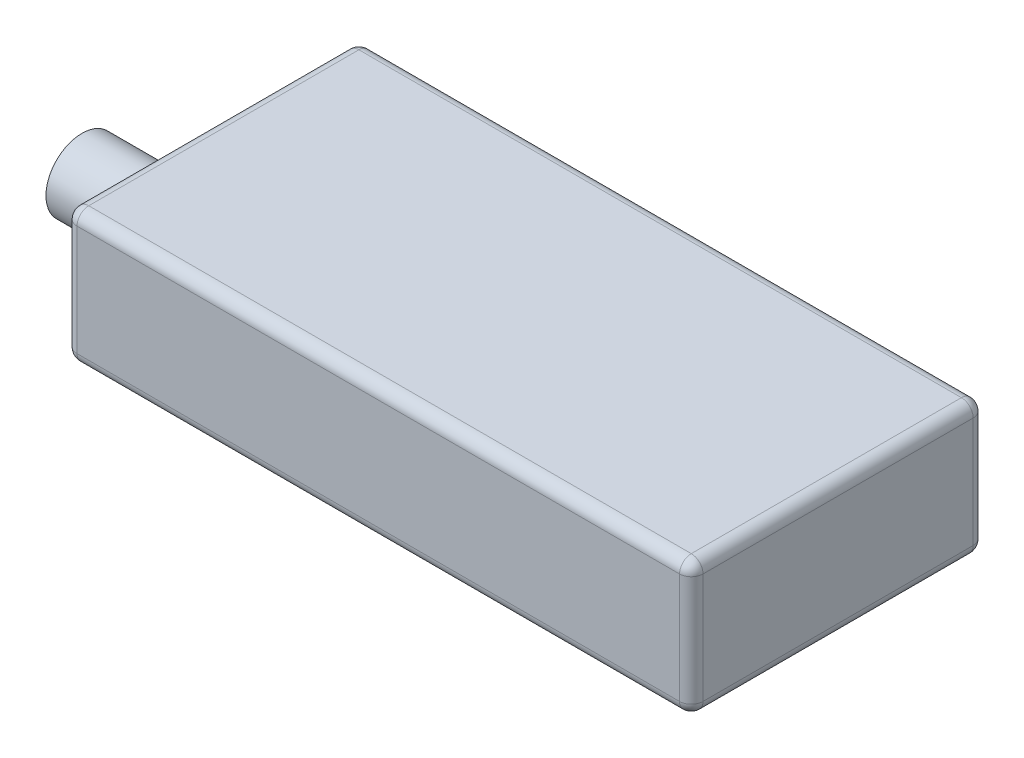
ISO-10303-21;
HEADER;
FILE_DESCRIPTION(('STEP AP214'),'2;1');
FILE_NAME('part.step','',(''),(''),'','','');
FILE_SCHEMA(('AUTOMOTIVE_DESIGN { 1 0 10303 214 1 1 1 1 }'));
ENDSEC;
DATA;
#1=APPLICATION_CONTEXT('core data for automotive mechanical design processes');
#2=APPLICATION_PROTOCOL_DEFINITION('international standard','automotive_design',2000,#1);
#3=PRODUCT_CONTEXT('',#1,'mechanical');
#4=PRODUCT('Part','Part','',(#3));
#5=PRODUCT_RELATED_PRODUCT_CATEGORY('part','',(#4));
#6=PRODUCT_DEFINITION_FORMATION('','',#4);
#7=PRODUCT_DEFINITION_CONTEXT('part definition',#1,'design');
#8=PRODUCT_DEFINITION('design','',#6,#7);
#9=PRODUCT_DEFINITION_SHAPE('','',#8);
#10=(LENGTH_UNIT() NAMED_UNIT(*) SI_UNIT(.MILLI.,.METRE.));
#11=(NAMED_UNIT(*) PLANE_ANGLE_UNIT() SI_UNIT($,.RADIAN.));
#12=(NAMED_UNIT(*) SI_UNIT($,.STERADIAN.) SOLID_ANGLE_UNIT());
#13=UNCERTAINTY_MEASURE_WITH_UNIT(LENGTH_MEASURE(1.E-05),#10,'distance_accuracy_value','');
#14=(GEOMETRIC_REPRESENTATION_CONTEXT(3) GLOBAL_UNCERTAINTY_ASSIGNED_CONTEXT((#13)) GLOBAL_UNIT_ASSIGNED_CONTEXT((#10,
#11,#12)) REPRESENTATION_CONTEXT('',''));
#15=CARTESIAN_POINT('',(0.,0.,0.));
#16=DIRECTION('',(0.,0.,1.));
#17=DIRECTION('',(1.,0.,0.));
#18=AXIS2_PLACEMENT_3D('',#15,#16,#17);
#19=CARTESIAN_POINT('',(26.65,11.4,12.5));
#20=DIRECTION('',(-1.,0.,0.));
#21=DIRECTION('',(0.,0.,1.));
#22=AXIS2_PLACEMENT_3D('',#19,#20,#21);
#23=PLANE('',#22);
#24=DIRECTION('',(0.,-1.,0.));
#25=VECTOR('',#24,1.);
#26=CARTESIAN_POINT('',(26.65,11.4,11.5));
#27=LINE('',#26,#25);
#28=CARTESIAN_POINT('',(26.65,10.4,11.5));
#29=VERTEX_POINT('',#28);
#30=CARTESIAN_POINT('',(26.65,1.,11.5));
#31=VERTEX_POINT('',#30);
#32=EDGE_CURVE('E169',#29,#31,#27,.T.);
#33=ORIENTED_EDGE('',*,*,#32,.T.);
#34=DIRECTION('',(0.,0.,-1.));
#35=VECTOR('',#34,1.);
#36=CARTESIAN_POINT('',(26.65,1.,-12.5));
#37=LINE('',#36,#35);
#38=CARTESIAN_POINT('',(26.65,1.,-11.5));
#39=VERTEX_POINT('',#38);
#40=EDGE_CURVE('E174',#31,#39,#37,.T.);
#41=ORIENTED_EDGE('',*,*,#40,.T.);
#42=DIRECTION('',(0.,-1.,0.));
#43=VECTOR('',#42,1.);
#44=CARTESIAN_POINT('',(26.65,11.4,-11.5));
#45=LINE('',#44,#43);
#46=CARTESIAN_POINT('',(26.65,10.4,-11.5));
#47=VERTEX_POINT('',#46);
#48=EDGE_CURVE('E171',#39,#47,#45,.F.);
#49=ORIENTED_EDGE('',*,*,#48,.T.);
#50=DIRECTION('',(0.,0.,-1.));
#51=VECTOR('',#50,1.);
#52=CARTESIAN_POINT('',(26.65,10.4,12.5));
#53=LINE('',#52,#51);
#54=EDGE_CURVE('E167',#47,#29,#53,.F.);
#55=ORIENTED_EDGE('',*,*,#54,.T.);
#56=EDGE_LOOP('',(#33,#41,#49,#55));
#57=FACE_BOUND('',#56,.T.);
#58=ADVANCED_FACE('F33',(#57),#23,.F.);
#59=CARTESIAN_POINT('',(-26.65,11.4,-12.5));
#60=DIRECTION('',(0.,0.,1.));
#61=DIRECTION('',(1.,0.,0.));
#62=AXIS2_PLACEMENT_3D('',#59,#60,#61);
#63=PLANE('',#62);
#64=DIRECTION('',(0.,-1.,0.));
#65=VECTOR('',#64,1.);
#66=CARTESIAN_POINT('',(25.65,11.4,-12.5));
#67=LINE('',#66,#65);
#68=CARTESIAN_POINT('',(25.65,10.4,-12.5));
#69=VERTEX_POINT('',#68);
#70=CARTESIAN_POINT('',(25.65,1.,-12.5));
#71=VERTEX_POINT('',#70);
#72=EDGE_CURVE('E132',#69,#71,#67,.T.);
#73=ORIENTED_EDGE('',*,*,#72,.T.);
#74=DIRECTION('',(-1.,0.,0.));
#75=VECTOR('',#74,1.);
#76=CARTESIAN_POINT('',(-26.65,1.,-12.5));
#77=LINE('',#76,#75);
#78=CARTESIAN_POINT('',(-25.65,1.,-12.5));
#79=VERTEX_POINT('',#78);
#80=EDGE_CURVE('E128',#71,#79,#77,.T.);
#81=ORIENTED_EDGE('',*,*,#80,.T.);
#82=DIRECTION('',(0.,-1.,0.));
#83=VECTOR('',#82,1.);
#84=CARTESIAN_POINT('',(-25.65,11.4,-12.5));
#85=LINE('',#84,#83);
#86=CARTESIAN_POINT('',(-25.65,10.4,-12.5));
#87=VERTEX_POINT('',#86);
#88=EDGE_CURVE('E120',#79,#87,#85,.F.);
#89=ORIENTED_EDGE('',*,*,#88,.T.);
#90=DIRECTION('',(-1.,0.,0.));
#91=VECTOR('',#90,1.);
#92=CARTESIAN_POINT('',(-26.65,10.4,-12.5));
#93=LINE('',#92,#91);
#94=EDGE_CURVE('E125',#87,#69,#93,.F.);
#95=ORIENTED_EDGE('',*,*,#94,.T.);
#96=EDGE_LOOP('',(#73,#81,#89,#95));
#97=FACE_BOUND('',#96,.T.);
#98=ADVANCED_FACE('F123',(#97),#63,.F.);
#99=CARTESIAN_POINT('',(-26.65,11.4,12.5));
#100=DIRECTION('',(1.,0.,0.));
#101=DIRECTION('',(0.,0.,-1.));
#102=AXIS2_PLACEMENT_3D('',#99,#100,#101);
#103=PLANE('',#102);
#104=CARTESIAN_POINT('',(-26.65,6.865,4.975));
#105=DIRECTION('',(1.,0.,0.));
#106=DIRECTION('',(0.,0.,-1.));
#107=AXIS2_PLACEMENT_3D('',#104,#105,#106);
#108=CIRCLE('',#107,3.065);
#109=CARTESIAN_POINT('',(-26.65,6.865,1.91));
#110=VERTEX_POINT('',#109);
#111=EDGE_CURVE('E11',#110,#110,#108,.F.);
#112=ORIENTED_EDGE('',*,*,#111,.F.);
#113=EDGE_LOOP('',(#112));
#114=FACE_BOUND('',#113,.T.);
#115=DIRECTION('',(0.,-1.,0.));
#116=VECTOR('',#115,1.);
#117=CARTESIAN_POINT('',(-26.65,11.4,-11.5));
#118=LINE('',#117,#116);
#119=CARTESIAN_POINT('',(-26.65,10.4,-11.5));
#120=VERTEX_POINT('',#119);
#121=CARTESIAN_POINT('',(-26.65,1.,-11.5));
#122=VERTEX_POINT('',#121);
#123=EDGE_CURVE('E140',#120,#122,#118,.T.);
#124=ORIENTED_EDGE('',*,*,#123,.T.);
#125=DIRECTION('',(0.,0.,1.));
#126=VECTOR('',#125,1.);
#127=CARTESIAN_POINT('',(-26.65,1.,12.5));
#128=LINE('',#127,#126);
#129=CARTESIAN_POINT('',(-26.65,1.,11.5));
#130=VERTEX_POINT('',#129);
#131=EDGE_CURVE('E181',#122,#130,#128,.T.);
#132=ORIENTED_EDGE('',*,*,#131,.T.);
#133=DIRECTION('',(0.,-1.,0.));
#134=VECTOR('',#133,1.);
#135=CARTESIAN_POINT('',(-26.65,11.4,11.5));
#136=LINE('',#135,#134);
#137=CARTESIAN_POINT('',(-26.65,10.4,11.5));
#138=VERTEX_POINT('',#137);
#139=EDGE_CURVE('E178',#130,#138,#136,.F.);
#140=ORIENTED_EDGE('',*,*,#139,.T.);
#141=DIRECTION('',(0.,0.,1.));
#142=VECTOR('',#141,1.);
#143=CARTESIAN_POINT('',(-26.65,10.4,12.5));
#144=LINE('',#143,#142);
#145=EDGE_CURVE('E176',#138,#120,#144,.F.);
#146=ORIENTED_EDGE('',*,*,#145,.T.);
#147=EDGE_LOOP('',(#124,#132,#140,#146));
#148=FACE_BOUND('',#147,.T.);
#149=ADVANCED_FACE('F329',(#114,#148),#103,.F.);
#150=CARTESIAN_POINT('',(-26.65,11.4,12.5));
#151=DIRECTION('',(0.,0.,-1.));
#152=DIRECTION('',(-1.,0.,0.));
#153=AXIS2_PLACEMENT_3D('',#150,#151,#152);
#154=PLANE('',#153);
#155=DIRECTION('',(0.,-1.,0.));
#156=VECTOR('',#155,1.);
#157=CARTESIAN_POINT('',(-25.65,11.4,12.5));
#158=LINE('',#157,#156);
#159=CARTESIAN_POINT('',(-25.65,10.4,12.5));
#160=VERTEX_POINT('',#159);
#161=CARTESIAN_POINT('',(-25.65,1.,12.5));
#162=VERTEX_POINT('',#161);
#163=EDGE_CURVE('E187',#160,#162,#158,.T.);
#164=ORIENTED_EDGE('',*,*,#163,.T.);
#165=DIRECTION('',(1.,0.,0.));
#166=VECTOR('',#165,1.);
#167=CARTESIAN_POINT('',(26.65,1.,12.5));
#168=LINE('',#167,#166);
#169=CARTESIAN_POINT('',(25.65,1.,12.5));
#170=VERTEX_POINT('',#169);
#171=EDGE_CURVE('E190',#162,#170,#168,.T.);
#172=ORIENTED_EDGE('',*,*,#171,.T.);
#173=DIRECTION('',(0.,-1.,0.));
#174=VECTOR('',#173,1.);
#175=CARTESIAN_POINT('',(25.65,11.4,12.5));
#176=LINE('',#175,#174);
#177=CARTESIAN_POINT('',(25.65,10.4,12.5));
#178=VERTEX_POINT('',#177);
#179=EDGE_CURVE('E185',#170,#178,#176,.F.);
#180=ORIENTED_EDGE('',*,*,#179,.T.);
#181=DIRECTION('',(1.,0.,0.));
#182=VECTOR('',#181,1.);
#183=CARTESIAN_POINT('',(-26.65,10.4,12.5));
#184=LINE('',#183,#182);
#185=EDGE_CURVE('E183',#178,#160,#184,.F.);
#186=ORIENTED_EDGE('',*,*,#185,.T.);
#187=EDGE_LOOP('',(#164,#172,#180,#186));
#188=FACE_BOUND('',#187,.T.);
#189=ADVANCED_FACE('F278',(#188),#154,.F.);
#190=CARTESIAN_POINT('',(0.,11.4,0.));
#191=DIRECTION('',(0.,-1.,0.));
#192=DIRECTION('',(0.,0.,-1.));
#193=AXIS2_PLACEMENT_3D('',#190,#191,#192);
#194=PLANE('',#193);
#195=DIRECTION('',(0.,0.,1.));
#196=VECTOR('',#195,1.);
#197=CARTESIAN_POINT('',(-25.65,11.4,0.));
#198=LINE('',#197,#196);
#199=CARTESIAN_POINT('',(-25.65,11.4,-11.5));
#200=VERTEX_POINT('',#199);
#201=CARTESIAN_POINT('',(-25.65,11.4,11.5));
#202=VERTEX_POINT('',#201);
#203=EDGE_CURVE('E48',#200,#202,#198,.T.);
#204=ORIENTED_EDGE('',*,*,#203,.T.);
#205=DIRECTION('',(1.,0.,0.));
#206=VECTOR('',#205,1.);
#207=CARTESIAN_POINT('',(0.,11.4,11.5));
#208=LINE('',#207,#206);
#209=CARTESIAN_POINT('',(25.65,11.4,11.5));
#210=VERTEX_POINT('',#209);
#211=EDGE_CURVE('E41',#202,#210,#208,.T.);
#212=ORIENTED_EDGE('',*,*,#211,.T.);
#213=DIRECTION('',(0.,0.,-1.));
#214=VECTOR('',#213,1.);
#215=CARTESIAN_POINT('',(25.65,11.4,0.));
#216=LINE('',#215,#214);
#217=CARTESIAN_POINT('',(25.65,11.4,-11.5));
#218=VERTEX_POINT('',#217);
#219=EDGE_CURVE('E201',#210,#218,#216,.T.);
#220=ORIENTED_EDGE('',*,*,#219,.T.);
#221=DIRECTION('',(-1.,0.,0.));
#222=VECTOR('',#221,1.);
#223=CARTESIAN_POINT('',(0.,11.4,-11.5));
#224=LINE('',#223,#222);
#225=EDGE_CURVE('E53',#218,#200,#224,.T.);
#226=ORIENTED_EDGE('',*,*,#225,.T.);
#227=EDGE_LOOP('',(#204,#212,#220,#226));
#228=FACE_BOUND('',#227,.T.);
#229=ADVANCED_FACE('F293',(#228),#194,.F.);
#230=CARTESIAN_POINT('',(0.,0.,0.));
#231=DIRECTION('',(0.,-1.,0.));
#232=DIRECTION('',(0.,0.,-1.));
#233=AXIS2_PLACEMENT_3D('',#230,#231,#232);
#234=PLANE('',#233);
#235=DIRECTION('',(0.,0.,1.));
#236=VECTOR('',#235,1.);
#237=CARTESIAN_POINT('',(-25.65,0.,-12.5));
#238=LINE('',#237,#236);
#239=CARTESIAN_POINT('',(-25.65,0.,11.5));
#240=VERTEX_POINT('',#239);
#241=CARTESIAN_POINT('',(-25.65,0.,-11.5));
#242=VERTEX_POINT('',#241);
#243=EDGE_CURVE('E196',#240,#242,#238,.F.);
#244=ORIENTED_EDGE('',*,*,#243,.T.);
#245=DIRECTION('',(-1.,0.,0.));
#246=VECTOR('',#245,1.);
#247=CARTESIAN_POINT('',(26.65,0.,-11.5));
#248=LINE('',#247,#246);
#249=CARTESIAN_POINT('',(25.65,0.,-11.5));
#250=VERTEX_POINT('',#249);
#251=EDGE_CURVE('E198',#242,#250,#248,.F.);
#252=ORIENTED_EDGE('',*,*,#251,.T.);
#253=DIRECTION('',(0.,0.,-1.));
#254=VECTOR('',#253,1.);
#255=CARTESIAN_POINT('',(25.65,0.,12.5));
#256=LINE('',#255,#254);
#257=CARTESIAN_POINT('',(25.65,0.,11.5));
#258=VERTEX_POINT('',#257);
#259=EDGE_CURVE('E192',#250,#258,#256,.F.);
#260=ORIENTED_EDGE('',*,*,#259,.T.);
#261=DIRECTION('',(1.,0.,0.));
#262=VECTOR('',#261,1.);
#263=CARTESIAN_POINT('',(-26.65,0.,11.5));
#264=LINE('',#263,#262);
#265=EDGE_CURVE('E194',#258,#240,#264,.F.);
#266=ORIENTED_EDGE('',*,*,#265,.T.);
#267=EDGE_LOOP('',(#244,#252,#260,#266));
#268=FACE_BOUND('',#267,.T.);
#269=ADVANCED_FACE('F269',(#268),#234,.T.);
#270=CARTESIAN_POINT('',(-25.65,11.4,11.5));
#271=DIRECTION('',(0.,-1.,0.));
#272=DIRECTION('',(0.,0.,-1.));
#273=AXIS2_PLACEMENT_3D('',#270,#271,#272);
#274=CYLINDRICAL_SURFACE('',#273,1.);
#275=CARTESIAN_POINT('',(-25.65,10.4,11.5));
#276=DIRECTION('',(0.,1.,0.));
#277=DIRECTION('',(0.,0.,1.));
#278=AXIS2_PLACEMENT_3D('',#275,#276,#277);
#279=CIRCLE('',#278,1.);
#280=EDGE_CURVE('E158',#138,#160,#279,.T.);
#281=ORIENTED_EDGE('',*,*,#280,.F.);
#282=ORIENTED_EDGE('',*,*,#139,.F.);
#283=CARTESIAN_POINT('',(-25.65,1.,11.5));
#284=DIRECTION('',(0.,-1.,0.));
#285=DIRECTION('',(0.,0.,-1.));
#286=AXIS2_PLACEMENT_3D('',#283,#284,#285);
#287=CIRCLE('',#286,1.);
#288=EDGE_CURVE('E161',#162,#130,#287,.T.);
#289=ORIENTED_EDGE('',*,*,#288,.F.);
#290=ORIENTED_EDGE('',*,*,#163,.F.);
#291=EDGE_LOOP('',(#281,#282,#289,#290));
#292=FACE_BOUND('',#291,.T.);
#293=ADVANCED_FACE('F35',(#292),#274,.T.);
#294=CARTESIAN_POINT('',(-25.65,10.4,11.5));
#295=DIRECTION('',(0.,0.,1.));
#296=DIRECTION('',(1.,0.,0.));
#297=AXIS2_PLACEMENT_3D('',#294,#295,#296);
#298=SPHERICAL_SURFACE('',#297,1.);
#299=CARTESIAN_POINT('',(-25.65,10.4,11.5));
#300=DIRECTION('',(0.,0.,1.));
#301=DIRECTION('',(1.,0.,0.));
#302=AXIS2_PLACEMENT_3D('',#299,#300,#301);
#303=CIRCLE('',#302,1.);
#304=EDGE_CURVE('E248',#138,#202,#303,.F.);
#305=ORIENTED_EDGE('',*,*,#304,.F.);
#306=ORIENTED_EDGE('',*,*,#280,.T.);
#307=CARTESIAN_POINT('',(-25.65,10.4,11.5));
#308=DIRECTION('',(-1.,0.,0.));
#309=DIRECTION('',(0.,0.,1.));
#310=AXIS2_PLACEMENT_3D('',#307,#308,#309);
#311=CIRCLE('',#310,1.);
#312=EDGE_CURVE('E250',#202,#160,#311,.F.);
#313=ORIENTED_EDGE('',*,*,#312,.F.);
#314=EDGE_LOOP('',(#305,#306,#313));
#315=FACE_BOUND('',#314,.T.);
#316=ADVANCED_FACE('F483',(#315),#298,.T.);
#317=CARTESIAN_POINT('',(-25.65,1.,11.5));
#318=DIRECTION('',(0.,0.,1.));
#319=DIRECTION('',(1.,0.,0.));
#320=AXIS2_PLACEMENT_3D('',#317,#318,#319);
#321=SPHERICAL_SURFACE('',#320,1.);
#322=CARTESIAN_POINT('',(-25.65,1.,11.5));
#323=DIRECTION('',(-1.,0.,0.));
#324=DIRECTION('',(0.,0.,1.));
#325=AXIS2_PLACEMENT_3D('',#322,#323,#324);
#326=CIRCLE('',#325,1.);
#327=EDGE_CURVE('E242',#162,#240,#326,.F.);
#328=ORIENTED_EDGE('',*,*,#327,.F.);
#329=ORIENTED_EDGE('',*,*,#288,.T.);
#330=CARTESIAN_POINT('',(-25.65,1.,11.5));
#331=DIRECTION('',(0.,0.,1.));
#332=DIRECTION('',(1.,0.,0.));
#333=AXIS2_PLACEMENT_3D('',#330,#331,#332);
#334=CIRCLE('',#333,1.);
#335=EDGE_CURVE('E245',#240,#130,#334,.F.);
#336=ORIENTED_EDGE('',*,*,#335,.F.);
#337=EDGE_LOOP('',(#328,#329,#336));
#338=FACE_BOUND('',#337,.T.);
#339=ADVANCED_FACE('F258',(#338),#321,.T.);
#340=CARTESIAN_POINT('',(0.,10.4,11.5));
#341=DIRECTION('',(1.,0.,0.));
#342=DIRECTION('',(0.,0.,-1.));
#343=AXIS2_PLACEMENT_3D('',#340,#341,#342);
#344=CYLINDRICAL_SURFACE('',#343,1.);
#345=ORIENTED_EDGE('',*,*,#312,.T.);
#346=ORIENTED_EDGE('',*,*,#185,.F.);
#347=CARTESIAN_POINT('',(25.65,10.4,11.5));
#348=DIRECTION('',(1.,0.,0.));
#349=DIRECTION('',(0.,0.,-1.));
#350=AXIS2_PLACEMENT_3D('',#347,#348,#349);
#351=CIRCLE('',#350,1.);
#352=EDGE_CURVE('E236',#210,#178,#351,.T.);
#353=ORIENTED_EDGE('',*,*,#352,.F.);
#354=ORIENTED_EDGE('',*,*,#211,.F.);
#355=EDGE_LOOP('',(#345,#346,#353,#354));
#356=FACE_BOUND('',#355,.T.);
#357=ADVANCED_FACE('F292',(#356),#344,.T.);
#358=CARTESIAN_POINT('',(-25.65,10.4,0.));
#359=DIRECTION('',(0.,0.,1.));
#360=DIRECTION('',(1.,0.,0.));
#361=AXIS2_PLACEMENT_3D('',#358,#359,#360);
#362=CYLINDRICAL_SURFACE('',#361,1.);
#363=ORIENTED_EDGE('',*,*,#304,.T.);
#364=ORIENTED_EDGE('',*,*,#203,.F.);
#365=CARTESIAN_POINT('',(-25.65,10.4,-11.5));
#366=DIRECTION('',(0.,0.,-1.));
#367=DIRECTION('',(0.,1.,0.));
#368=AXIS2_PLACEMENT_3D('',#365,#366,#367);
#369=CIRCLE('',#368,1.);
#370=EDGE_CURVE('E144',#120,#200,#369,.T.);
#371=ORIENTED_EDGE('',*,*,#370,.F.);
#372=ORIENTED_EDGE('',*,*,#145,.F.);
#373=EDGE_LOOP('',(#363,#364,#371,#372));
#374=FACE_BOUND('',#373,.T.);
#375=ADVANCED_FACE('F460',(#374),#362,.T.);
#376=CARTESIAN_POINT('',(-25.65,11.4,-11.5));
#377=DIRECTION('',(0.,-1.,0.));
#378=DIRECTION('',(0.,0.,-1.));
#379=AXIS2_PLACEMENT_3D('',#376,#377,#378);
#380=CYLINDRICAL_SURFACE('',#379,1.);
#381=CARTESIAN_POINT('',(-25.65,1.,-11.5));
#382=DIRECTION('',(0.,-1.,0.));
#383=DIRECTION('',(0.,0.,-1.));
#384=AXIS2_PLACEMENT_3D('',#381,#382,#383);
#385=CIRCLE('',#384,1.);
#386=EDGE_CURVE('E145',#122,#79,#385,.T.);
#387=ORIENTED_EDGE('',*,*,#386,.F.);
#388=ORIENTED_EDGE('',*,*,#123,.F.);
#389=CARTESIAN_POINT('',(-25.65,10.4,-11.5));
#390=DIRECTION('',(0.,1.,0.));
#391=DIRECTION('',(0.,0.,1.));
#392=AXIS2_PLACEMENT_3D('',#389,#390,#391);
#393=CIRCLE('',#392,1.);
#394=EDGE_CURVE('E136',#87,#120,#393,.T.);
#395=ORIENTED_EDGE('',*,*,#394,.F.);
#396=ORIENTED_EDGE('',*,*,#88,.F.);
#397=EDGE_LOOP('',(#387,#388,#395,#396));
#398=FACE_BOUND('',#397,.T.);
#399=ADVANCED_FACE('F138',(#398),#380,.T.);
#400=CARTESIAN_POINT('',(-25.65,1.,12.5));
#401=DIRECTION('',(0.,0.,-1.));
#402=DIRECTION('',(-1.,0.,0.));
#403=AXIS2_PLACEMENT_3D('',#400,#401,#402);
#404=CYLINDRICAL_SURFACE('',#403,1.);
#405=ORIENTED_EDGE('',*,*,#335,.T.);
#406=ORIENTED_EDGE('',*,*,#131,.F.);
#407=CARTESIAN_POINT('',(-25.65,1.,-11.5));
#408=DIRECTION('',(0.,0.,-1.));
#409=DIRECTION('',(-1.,0.,0.));
#410=AXIS2_PLACEMENT_3D('',#407,#408,#409);
#411=CIRCLE('',#410,1.);
#412=EDGE_CURVE('E232',#242,#122,#411,.T.);
#413=ORIENTED_EDGE('',*,*,#412,.F.);
#414=ORIENTED_EDGE('',*,*,#243,.F.);
#415=EDGE_LOOP('',(#405,#406,#413,#414));
#416=FACE_BOUND('',#415,.T.);
#417=ADVANCED_FACE('F265',(#416),#404,.T.);
#418=CARTESIAN_POINT('',(-26.65,1.,11.5));
#419=DIRECTION('',(-1.,0.,0.));
#420=DIRECTION('',(0.,0.,1.));
#421=AXIS2_PLACEMENT_3D('',#418,#419,#420);
#422=CYLINDRICAL_SURFACE('',#421,1.);
#423=ORIENTED_EDGE('',*,*,#327,.T.);
#424=ORIENTED_EDGE('',*,*,#265,.F.);
#425=CARTESIAN_POINT('',(25.65,1.,11.5));
#426=DIRECTION('',(1.,0.,0.));
#427=DIRECTION('',(0.,0.,-1.));
#428=AXIS2_PLACEMENT_3D('',#425,#426,#427);
#429=CIRCLE('',#428,1.);
#430=EDGE_CURVE('E229',#170,#258,#429,.T.);
#431=ORIENTED_EDGE('',*,*,#430,.F.);
#432=ORIENTED_EDGE('',*,*,#171,.F.);
#433=EDGE_LOOP('',(#423,#424,#431,#432));
#434=FACE_BOUND('',#433,.T.);
#435=ADVANCED_FACE('F275',(#434),#422,.T.);
#436=CARTESIAN_POINT('',(25.65,11.4,11.5));
#437=DIRECTION('',(0.,-1.,0.));
#438=DIRECTION('',(0.,0.,-1.));
#439=AXIS2_PLACEMENT_3D('',#436,#437,#438);
#440=CYLINDRICAL_SURFACE('',#439,1.);
#441=CARTESIAN_POINT('',(25.65,10.4,11.5));
#442=DIRECTION('',(0.,1.,0.));
#443=DIRECTION('',(0.,0.,1.));
#444=AXIS2_PLACEMENT_3D('',#441,#442,#443);
#445=CIRCLE('',#444,1.);
#446=EDGE_CURVE('E239',#178,#29,#445,.T.);
#447=ORIENTED_EDGE('',*,*,#446,.F.);
#448=ORIENTED_EDGE('',*,*,#179,.F.);
#449=CARTESIAN_POINT('',(25.65,1.,11.5));
#450=DIRECTION('',(0.,-1.,0.));
#451=DIRECTION('',(0.,0.,-1.));
#452=AXIS2_PLACEMENT_3D('',#449,#450,#451);
#453=CIRCLE('',#452,1.);
#454=EDGE_CURVE('E226',#31,#170,#453,.T.);
#455=ORIENTED_EDGE('',*,*,#454,.F.);
#456=ORIENTED_EDGE('',*,*,#32,.F.);
#457=EDGE_LOOP('',(#447,#448,#455,#456));
#458=FACE_BOUND('',#457,.T.);
#459=ADVANCED_FACE('F283',(#458),#440,.T.);
#460=CARTESIAN_POINT('',(25.65,10.4,11.5));
#461=DIRECTION('',(0.,0.,1.));
#462=DIRECTION('',(1.,0.,0.));
#463=AXIS2_PLACEMENT_3D('',#460,#461,#462);
#464=SPHERICAL_SURFACE('',#463,1.);
#465=ORIENTED_EDGE('',*,*,#352,.T.);
#466=ORIENTED_EDGE('',*,*,#446,.T.);
#467=CARTESIAN_POINT('',(25.65,10.4,11.5));
#468=DIRECTION('',(0.,0.,1.));
#469=DIRECTION('',(1.,0.,0.));
#470=AXIS2_PLACEMENT_3D('',#467,#468,#469);
#471=CIRCLE('',#470,1.);
#472=EDGE_CURVE('E151',#210,#29,#471,.F.);
#473=ORIENTED_EDGE('',*,*,#472,.F.);
#474=EDGE_LOOP('',(#465,#466,#473));
#475=FACE_BOUND('',#474,.T.);
#476=ADVANCED_FACE('F289',(#475),#464,.T.);
#477=CARTESIAN_POINT('',(-25.65,10.4,-11.5));
#478=DIRECTION('',(0.,0.,1.));
#479=DIRECTION('',(1.,0.,0.));
#480=AXIS2_PLACEMENT_3D('',#477,#478,#479);
#481=SPHERICAL_SURFACE('',#480,1.);
#482=ORIENTED_EDGE('',*,*,#394,.T.);
#483=ORIENTED_EDGE('',*,*,#370,.T.);
#484=CARTESIAN_POINT('',(-25.65,10.4,-11.5));
#485=DIRECTION('',(-1.,0.,0.));
#486=DIRECTION('',(0.,0.,1.));
#487=AXIS2_PLACEMENT_3D('',#484,#485,#486);
#488=CIRCLE('',#487,1.);
#489=EDGE_CURVE('E148',#87,#200,#488,.F.);
#490=ORIENTED_EDGE('',*,*,#489,.F.);
#491=EDGE_LOOP('',(#482,#483,#490));
#492=FACE_BOUND('',#491,.T.);
#493=ADVANCED_FACE('F149',(#492),#481,.T.);
#494=CARTESIAN_POINT('',(-25.65,1.,-11.5));
#495=DIRECTION('',(0.,0.,1.));
#496=DIRECTION('',(1.,0.,0.));
#497=AXIS2_PLACEMENT_3D('',#494,#495,#496);
#498=SPHERICAL_SURFACE('',#497,1.);
#499=ORIENTED_EDGE('',*,*,#412,.T.);
#500=ORIENTED_EDGE('',*,*,#386,.T.);
#501=CARTESIAN_POINT('',(-25.65,1.,-11.5));
#502=DIRECTION('',(-1.,0.,0.));
#503=DIRECTION('',(0.,0.,1.));
#504=AXIS2_PLACEMENT_3D('',#501,#502,#503);
#505=CIRCLE('',#504,1.);
#506=EDGE_CURVE('E152',#242,#79,#505,.F.);
#507=ORIENTED_EDGE('',*,*,#506,.F.);
#508=EDGE_LOOP('',(#499,#500,#507));
#509=FACE_BOUND('',#508,.T.);
#510=ADVANCED_FACE('F312',(#509),#498,.T.);
#511=CARTESIAN_POINT('',(25.65,1.,11.5));
#512=DIRECTION('',(0.,0.,1.));
#513=DIRECTION('',(1.,0.,0.));
#514=AXIS2_PLACEMENT_3D('',#511,#512,#513);
#515=SPHERICAL_SURFACE('',#514,1.);
#516=ORIENTED_EDGE('',*,*,#454,.T.);
#517=ORIENTED_EDGE('',*,*,#430,.T.);
#518=CARTESIAN_POINT('',(25.65,1.,11.5));
#519=DIRECTION('',(0.,0.,1.));
#520=DIRECTION('',(1.,0.,0.));
#521=AXIS2_PLACEMENT_3D('',#518,#519,#520);
#522=CIRCLE('',#521,1.);
#523=EDGE_CURVE('E219',#31,#258,#522,.F.);
#524=ORIENTED_EDGE('',*,*,#523,.F.);
#525=EDGE_LOOP('',(#516,#517,#524));
#526=FACE_BOUND('',#525,.T.);
#527=ADVANCED_FACE('F314',(#526),#515,.T.);
#528=CARTESIAN_POINT('',(25.65,10.4,0.));
#529=DIRECTION('',(0.,0.,-1.));
#530=DIRECTION('',(-1.,0.,0.));
#531=AXIS2_PLACEMENT_3D('',#528,#529,#530);
#532=CYLINDRICAL_SURFACE('',#531,1.);
#533=ORIENTED_EDGE('',*,*,#472,.T.);
#534=ORIENTED_EDGE('',*,*,#54,.F.);
#535=CARTESIAN_POINT('',(25.65,10.4,-11.5));
#536=DIRECTION('',(0.,0.,-1.));
#537=DIRECTION('',(-1.,0.,0.));
#538=AXIS2_PLACEMENT_3D('',#535,#536,#537);
#539=CIRCLE('',#538,1.);
#540=EDGE_CURVE('E216',#218,#47,#539,.T.);
#541=ORIENTED_EDGE('',*,*,#540,.F.);
#542=ORIENTED_EDGE('',*,*,#219,.F.);
#543=EDGE_LOOP('',(#533,#534,#541,#542));
#544=FACE_BOUND('',#543,.T.);
#545=ADVANCED_FACE('F297',(#544),#532,.T.);
#546=CARTESIAN_POINT('',(0.,10.4,-11.5));
#547=DIRECTION('',(-1.,0.,0.));
#548=DIRECTION('',(0.,0.,1.));
#549=AXIS2_PLACEMENT_3D('',#546,#547,#548);
#550=CYLINDRICAL_SURFACE('',#549,1.);
#551=ORIENTED_EDGE('',*,*,#489,.T.);
#552=ORIENTED_EDGE('',*,*,#225,.F.);
#553=CARTESIAN_POINT('',(25.65,10.4,-11.5));
#554=DIRECTION('',(1.,0.,0.));
#555=DIRECTION('',(0.,0.,-1.));
#556=AXIS2_PLACEMENT_3D('',#553,#554,#555);
#557=CIRCLE('',#556,1.);
#558=EDGE_CURVE('E156',#69,#218,#557,.T.);
#559=ORIENTED_EDGE('',*,*,#558,.F.);
#560=ORIENTED_EDGE('',*,*,#94,.F.);
#561=EDGE_LOOP('',(#551,#552,#559,#560));
#562=FACE_BOUND('',#561,.T.);
#563=ADVANCED_FACE('F154',(#562),#550,.T.);
#564=CARTESIAN_POINT('',(-26.65,1.,-11.5));
#565=DIRECTION('',(1.,0.,0.));
#566=DIRECTION('',(0.,0.,-1.));
#567=AXIS2_PLACEMENT_3D('',#564,#565,#566);
#568=CYLINDRICAL_SURFACE('',#567,1.);
#569=ORIENTED_EDGE('',*,*,#506,.T.);
#570=ORIENTED_EDGE('',*,*,#80,.F.);
#571=CARTESIAN_POINT('',(25.65,1.,-11.5));
#572=DIRECTION('',(1.,0.,0.));
#573=DIRECTION('',(0.,0.,-1.));
#574=AXIS2_PLACEMENT_3D('',#571,#572,#573);
#575=CIRCLE('',#574,1.);
#576=EDGE_CURVE('E212',#250,#71,#575,.T.);
#577=ORIENTED_EDGE('',*,*,#576,.F.);
#578=ORIENTED_EDGE('',*,*,#251,.F.);
#579=EDGE_LOOP('',(#569,#570,#577,#578));
#580=FACE_BOUND('',#579,.T.);
#581=ADVANCED_FACE('F310',(#580),#568,.T.);
#582=CARTESIAN_POINT('',(25.65,1.,12.5));
#583=DIRECTION('',(0.,0.,1.));
#584=DIRECTION('',(1.,0.,0.));
#585=AXIS2_PLACEMENT_3D('',#582,#583,#584);
#586=CYLINDRICAL_SURFACE('',#585,1.);
#587=ORIENTED_EDGE('',*,*,#523,.T.);
#588=ORIENTED_EDGE('',*,*,#259,.F.);
#589=CARTESIAN_POINT('',(25.65,1.,-11.5));
#590=DIRECTION('',(0.,0.,-1.));
#591=DIRECTION('',(-1.,0.,0.));
#592=AXIS2_PLACEMENT_3D('',#589,#590,#591);
#593=CIRCLE('',#592,1.);
#594=EDGE_CURVE('E210',#39,#250,#593,.T.);
#595=ORIENTED_EDGE('',*,*,#594,.F.);
#596=ORIENTED_EDGE('',*,*,#40,.F.);
#597=EDGE_LOOP('',(#587,#588,#595,#596));
#598=FACE_BOUND('',#597,.T.);
#599=ADVANCED_FACE('F340',(#598),#586,.T.);
#600=CARTESIAN_POINT('',(25.65,10.4,-11.5));
#601=DIRECTION('',(0.,0.,1.));
#602=DIRECTION('',(1.,0.,0.));
#603=AXIS2_PLACEMENT_3D('',#600,#601,#602);
#604=SPHERICAL_SURFACE('',#603,1.);
#605=ORIENTED_EDGE('',*,*,#558,.T.);
#606=ORIENTED_EDGE('',*,*,#540,.T.);
#607=CARTESIAN_POINT('',(25.65,10.4,-11.5));
#608=DIRECTION('',(0.,1.,0.));
#609=DIRECTION('',(0.,0.,1.));
#610=AXIS2_PLACEMENT_3D('',#607,#608,#609);
#611=CIRCLE('',#610,1.);
#612=EDGE_CURVE('E208',#69,#47,#611,.F.);
#613=ORIENTED_EDGE('',*,*,#612,.F.);
#614=EDGE_LOOP('',(#605,#606,#613));
#615=FACE_BOUND('',#614,.T.);
#616=ADVANCED_FACE('F299',(#615),#604,.T.);
#617=CARTESIAN_POINT('',(25.65,1.,-11.5));
#618=DIRECTION('',(0.,0.,1.));
#619=DIRECTION('',(1.,0.,0.));
#620=AXIS2_PLACEMENT_3D('',#617,#618,#619);
#621=SPHERICAL_SURFACE('',#620,1.);
#622=ORIENTED_EDGE('',*,*,#594,.T.);
#623=ORIENTED_EDGE('',*,*,#576,.T.);
#624=CARTESIAN_POINT('',(25.65,1.,-11.5));
#625=DIRECTION('',(0.,-1.,0.));
#626=DIRECTION('',(0.,0.,-1.));
#627=AXIS2_PLACEMENT_3D('',#624,#625,#626);
#628=CIRCLE('',#627,1.);
#629=EDGE_CURVE('E206',#39,#71,#628,.F.);
#630=ORIENTED_EDGE('',*,*,#629,.F.);
#631=EDGE_LOOP('',(#622,#623,#630));
#632=FACE_BOUND('',#631,.T.);
#633=ADVANCED_FACE('F307',(#632),#621,.T.);
#634=CARTESIAN_POINT('',(25.65,11.4,-11.5));
#635=DIRECTION('',(0.,-1.,0.));
#636=DIRECTION('',(0.,0.,-1.));
#637=AXIS2_PLACEMENT_3D('',#634,#635,#636);
#638=CYLINDRICAL_SURFACE('',#637,1.);
#639=ORIENTED_EDGE('',*,*,#612,.T.);
#640=ORIENTED_EDGE('',*,*,#48,.F.);
#641=ORIENTED_EDGE('',*,*,#629,.T.);
#642=ORIENTED_EDGE('',*,*,#72,.F.);
#643=EDGE_LOOP('',(#639,#640,#641,#642));
#644=FACE_BOUND('',#643,.T.);
#645=ADVANCED_FACE('F303',(#644),#638,.T.);
#646=CARTESIAN_POINT('',(-32.75,6.865,4.975));
#647=DIRECTION('',(1.,0.,0.));
#648=DIRECTION('',(0.,0.,-1.));
#649=AXIS2_PLACEMENT_3D('',#646,#647,#648);
#650=CYLINDRICAL_SURFACE('',#649,3.065);
#651=CARTESIAN_POINT('',(-32.75,6.865,4.975));
#652=DIRECTION('',(-1.,0.,0.));
#653=DIRECTION('',(0.,0.,1.));
#654=AXIS2_PLACEMENT_3D('',#651,#652,#653);
#655=CIRCLE('',#654,3.065);
#656=CARTESIAN_POINT('',(-32.75,6.865,8.04));
#657=VERTEX_POINT('',#656);
#658=EDGE_CURVE('E163',#657,#657,#655,.T.);
#659=ORIENTED_EDGE('',*,*,#658,.F.);
#660=EDGE_LOOP('',(#659));
#661=FACE_BOUND('',#660,.T.);
#662=ORIENTED_EDGE('',*,*,#111,.T.);
#663=EDGE_LOOP('',(#662));
#664=FACE_BOUND('',#663,.T.);
#665=ADVANCED_FACE('F335',(#661,#664),#650,.T.);
#666=CARTESIAN_POINT('',(-32.75,6.865,4.975));
#667=DIRECTION('',(-1.,0.,0.));
#668=DIRECTION('',(0.,0.,1.));
#669=AXIS2_PLACEMENT_3D('',#666,#667,#668);
#670=PLANE('',#669);
#671=ORIENTED_EDGE('',*,*,#658,.T.);
#672=EDGE_LOOP('',(#671));
#673=FACE_BOUND('',#672,.T.);
#674=ADVANCED_FACE('F384',(#673),#670,.T.);
#675=CLOSED_SHELL('',(#58,#98,#149,#189,#229,#269,#293,#316,#339,#357,#375,#399,#417,#435,#459,
#476,#493,#510,#527,#545,#563,#581,#599,#616,#633,#645,#665,#674));
#676=MANIFOLD_SOLID_BREP('B2',#675);
#677=ADVANCED_BREP_SHAPE_REPRESENTATION('',(#18,#676),#14);
#678=SHAPE_DEFINITION_REPRESENTATION(#9,#677);
ENDSEC;
END-ISO-10303-21;
